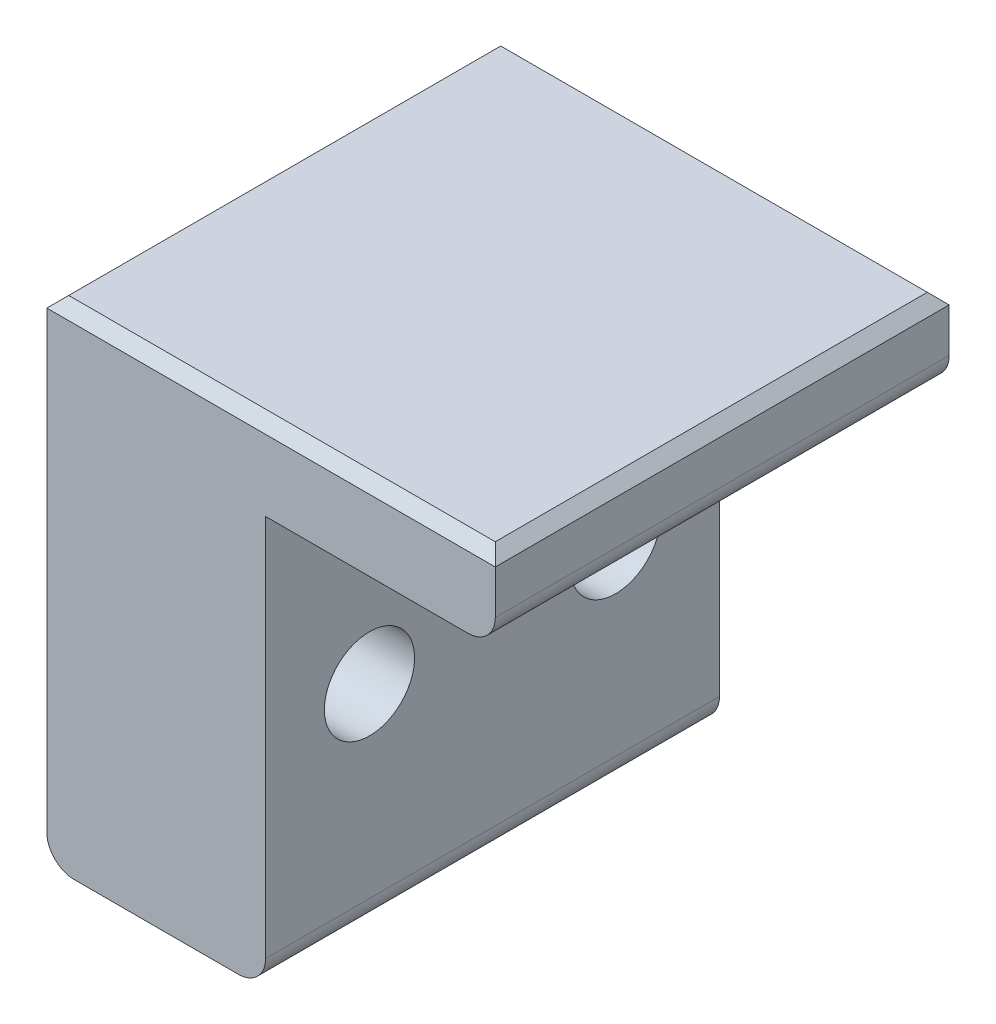
ISO-10303-21;
HEADER;
FILE_DESCRIPTION(('STEP AP214'),'2;1');
FILE_NAME('part.step','',(''),(''),'','','');
FILE_SCHEMA(('AUTOMOTIVE_DESIGN { 1 0 10303 214 1 1 1 1 }'));
ENDSEC;
DATA;
#1=APPLICATION_CONTEXT('core data for automotive mechanical design processes');
#2=APPLICATION_PROTOCOL_DEFINITION('international standard','automotive_design',2000,#1);
#3=PRODUCT_CONTEXT('',#1,'mechanical');
#4=PRODUCT('Part','Part','',(#3));
#5=PRODUCT_RELATED_PRODUCT_CATEGORY('part','',(#4));
#6=PRODUCT_DEFINITION_FORMATION('','',#4);
#7=PRODUCT_DEFINITION_CONTEXT('part definition',#1,'design');
#8=PRODUCT_DEFINITION('design','',#6,#7);
#9=PRODUCT_DEFINITION_SHAPE('','',#8);
#10=(LENGTH_UNIT() NAMED_UNIT(*) SI_UNIT(.MILLI.,.METRE.));
#11=(NAMED_UNIT(*) PLANE_ANGLE_UNIT() SI_UNIT($,.RADIAN.));
#12=(NAMED_UNIT(*) SI_UNIT($,.STERADIAN.) SOLID_ANGLE_UNIT());
#13=UNCERTAINTY_MEASURE_WITH_UNIT(LENGTH_MEASURE(1.E-05),#10,'distance_accuracy_value','');
#14=(GEOMETRIC_REPRESENTATION_CONTEXT(3) GLOBAL_UNCERTAINTY_ASSIGNED_CONTEXT((#13)) GLOBAL_UNIT_ASSIGNED_CONTEXT((#10,
#11,#12)) REPRESENTATION_CONTEXT('',''));
#15=CARTESIAN_POINT('',(0.,0.,0.));
#16=DIRECTION('',(0.,0.,1.));
#17=DIRECTION('',(1.,0.,0.));
#18=AXIS2_PLACEMENT_3D('',#15,#16,#17);
#19=CARTESIAN_POINT('',(0.,-15.,16.6));
#20=DIRECTION('',(-1.,0.,0.));
#21=DIRECTION('',(0.,0.,1.));
#22=AXIS2_PLACEMENT_3D('',#19,#20,#21);
#23=PLANE('',#22);
#24=CARTESIAN_POINT('',(0.,-7.19999999999998,3.80000000000002));
#25=DIRECTION('',(-1.,0.,0.));
#26=DIRECTION('',(0.,0.,1.));
#27=AXIS2_PLACEMENT_3D('',#24,#25,#26);
#28=CIRCLE('',#27,1.65);
#29=CARTESIAN_POINT('',(0.,-7.19999999999998,5.45000000000001));
#30=VERTEX_POINT('',#29);
#31=EDGE_CURVE('E223',#30,#30,#28,.T.);
#32=ORIENTED_EDGE('',*,*,#31,.T.);
#33=EDGE_LOOP('',(#32));
#34=FACE_BOUND('',#33,.T.);
#35=CARTESIAN_POINT('',(0.,-7.19999999999998,12.8));
#36=DIRECTION('',(-1.,0.,0.));
#37=DIRECTION('',(0.,0.,1.));
#38=AXIS2_PLACEMENT_3D('',#35,#36,#37);
#39=CIRCLE('',#38,1.65);
#40=CARTESIAN_POINT('',(0.,-7.19999999999998,14.45));
#41=VERTEX_POINT('',#40);
#42=EDGE_CURVE('E229',#41,#41,#39,.T.);
#43=ORIENTED_EDGE('',*,*,#42,.T.);
#44=EDGE_LOOP('',(#43));
#45=FACE_BOUND('',#44,.T.);
#46=DIRECTION('',(0.,1.,0.));
#47=VECTOR('',#46,1.);
#48=CARTESIAN_POINT('',(0.,-15.,16.6));
#49=LINE('',#48,#47);
#50=CARTESIAN_POINT('',(0.,-14.,16.6));
#51=VERTEX_POINT('',#50);
#52=CARTESIAN_POINT('',(0.,0.,16.6));
#53=VERTEX_POINT('',#52);
#54=EDGE_CURVE('E127',#51,#53,#49,.T.);
#55=ORIENTED_EDGE('',*,*,#54,.F.);
#56=DIRECTION('',(0.,0.,-1.));
#57=VECTOR('',#56,1.);
#58=CARTESIAN_POINT('',(0.,-14.,16.6));
#59=LINE('',#58,#57);
#60=CARTESIAN_POINT('',(0.,-14.,0.));
#61=VERTEX_POINT('',#60);
#62=EDGE_CURVE('E202',#51,#61,#59,.T.);
#63=ORIENTED_EDGE('',*,*,#62,.T.);
#64=DIRECTION('',(0.,1.,0.));
#65=VECTOR('',#64,1.);
#66=CARTESIAN_POINT('',(0.,-15.,0.));
#67=LINE('',#66,#65);
#68=CARTESIAN_POINT('',(0.,0.,0.));
#69=VERTEX_POINT('',#68);
#70=EDGE_CURVE('E144',#61,#69,#67,.T.);
#71=ORIENTED_EDGE('',*,*,#70,.T.);
#72=DIRECTION('',(0.,0.,-1.));
#73=VECTOR('',#72,1.);
#74=CARTESIAN_POINT('',(0.,0.,16.6));
#75=LINE('',#74,#73);
#76=EDGE_CURVE('E140',#53,#69,#75,.T.);
#77=ORIENTED_EDGE('',*,*,#76,.F.);
#78=EDGE_LOOP('',(#55,#63,#71,#77));
#79=FACE_BOUND('',#78,.T.);
#80=ADVANCED_FACE('F46',(#34,#45,#79),#23,.F.);
#81=CARTESIAN_POINT('',(0.,0.,16.6));
#82=DIRECTION('',(0.,1.,0.));
#83=DIRECTION('',(0.,0.,1.));
#84=AXIS2_PLACEMENT_3D('',#81,#82,#83);
#85=PLANE('',#84);
#86=DIRECTION('',(1.,0.,0.));
#87=VECTOR('',#86,1.);
#88=CARTESIAN_POINT('',(0.,0.,0.));
#89=LINE('',#88,#87);
#90=CARTESIAN_POINT('',(7.4,0.,0.));
#91=VERTEX_POINT('',#90);
#92=EDGE_CURVE('E218',#69,#91,#89,.T.);
#93=ORIENTED_EDGE('',*,*,#92,.T.);
#94=DIRECTION('',(0.,0.,-1.));
#95=VECTOR('',#94,1.);
#96=CARTESIAN_POINT('',(7.4,0.,16.6));
#97=LINE('',#96,#95);
#98=CARTESIAN_POINT('',(7.4,0.,16.6));
#99=VERTEX_POINT('',#98);
#100=EDGE_CURVE('E11',#91,#99,#97,.F.);
#101=ORIENTED_EDGE('',*,*,#100,.T.);
#102=DIRECTION('',(1.,0.,0.));
#103=VECTOR('',#102,1.);
#104=CARTESIAN_POINT('',(0.,0.,16.6));
#105=LINE('',#104,#103);
#106=EDGE_CURVE('E130',#53,#99,#105,.T.);
#107=ORIENTED_EDGE('',*,*,#106,.F.);
#108=ORIENTED_EDGE('',*,*,#76,.T.);
#109=EDGE_LOOP('',(#93,#101,#107,#108));
#110=FACE_BOUND('',#109,.T.);
#111=ADVANCED_FACE('F139',(#110),#85,.F.);
#112=CARTESIAN_POINT('',(8.4,0.,16.6));
#113=DIRECTION('',(-1.,0.,0.));
#114=DIRECTION('',(0.,-1.,0.));
#115=AXIS2_PLACEMENT_3D('',#112,#113,#114);
#116=PLANE('',#115);
#117=DIRECTION('',(0.,1.,0.));
#118=VECTOR('',#117,1.);
#119=CARTESIAN_POINT('',(8.4,0.,16.6));
#120=LINE('',#119,#118);
#121=CARTESIAN_POINT('',(8.4,1.,16.6));
#122=VERTEX_POINT('',#121);
#123=CARTESIAN_POINT('',(8.4,2.6,16.6));
#124=VERTEX_POINT('',#123);
#125=EDGE_CURVE('E141',#122,#124,#120,.T.);
#126=ORIENTED_EDGE('',*,*,#125,.F.);
#127=DIRECTION('',(0.,0.,-1.));
#128=VECTOR('',#127,1.);
#129=CARTESIAN_POINT('',(8.4,1.,16.6));
#130=LINE('',#129,#128);
#131=CARTESIAN_POINT('',(8.4,1.,0.));
#132=VERTEX_POINT('',#131);
#133=EDGE_CURVE('E54',#122,#132,#130,.T.);
#134=ORIENTED_EDGE('',*,*,#133,.T.);
#135=DIRECTION('',(0.,1.,0.));
#136=VECTOR('',#135,1.);
#137=CARTESIAN_POINT('',(8.4,0.,0.));
#138=LINE('',#137,#136);
#139=CARTESIAN_POINT('',(8.4,2.6,0.));
#140=VERTEX_POINT('',#139);
#141=EDGE_CURVE('E209',#132,#140,#138,.T.);
#142=ORIENTED_EDGE('',*,*,#141,.T.);
#143=DIRECTION('',(0.,0.,1.));
#144=VECTOR('',#143,1.);
#145=CARTESIAN_POINT('',(8.4,2.6,16.6));
#146=LINE('',#145,#144);
#147=EDGE_CURVE('E162',#140,#124,#146,.T.);
#148=ORIENTED_EDGE('',*,*,#147,.T.);
#149=EDGE_LOOP('',(#126,#134,#142,#148));
#150=FACE_BOUND('',#149,.T.);
#151=ADVANCED_FACE('F208',(#150),#116,.F.);
#152=CARTESIAN_POINT('',(8.4,3.,16.6));
#153=DIRECTION('',(0.,-1.,0.));
#154=DIRECTION('',(1.,0.,0.));
#155=AXIS2_PLACEMENT_3D('',#152,#153,#154);
#156=PLANE('',#155);
#157=DIRECTION('',(1.,0.,0.));
#158=VECTOR('',#157,1.);
#159=CARTESIAN_POINT('',(8.4,3.,16.2));
#160=LINE('',#159,#158);
#161=CARTESIAN_POINT('',(-7.6,3.,16.2));
#162=VERTEX_POINT('',#161);
#163=CARTESIAN_POINT('',(8.,3.,16.2));
#164=VERTEX_POINT('',#163);
#165=EDGE_CURVE('E157',#162,#164,#160,.T.);
#166=ORIENTED_EDGE('',*,*,#165,.T.);
#167=DIRECTION('',(0.,0.,-1.));
#168=VECTOR('',#167,1.);
#169=CARTESIAN_POINT('',(8.,3.,16.6));
#170=LINE('',#169,#168);
#171=CARTESIAN_POINT('',(8.,3.,0.399999999999998));
#172=VERTEX_POINT('',#171);
#173=EDGE_CURVE('E159',#164,#172,#170,.T.);
#174=ORIENTED_EDGE('',*,*,#173,.T.);
#175=DIRECTION('',(-1.,0.,0.));
#176=VECTOR('',#175,1.);
#177=CARTESIAN_POINT('',(-8.,3.,0.399999999999998));
#178=LINE('',#177,#176);
#179=CARTESIAN_POINT('',(-7.6,3.,0.399999999999998));
#180=VERTEX_POINT('',#179);
#181=EDGE_CURVE('E146',#172,#180,#178,.T.);
#182=ORIENTED_EDGE('',*,*,#181,.T.);
#183=DIRECTION('',(0.,0.,1.));
#184=VECTOR('',#183,1.);
#185=CARTESIAN_POINT('',(-7.6,3.,16.6));
#186=LINE('',#185,#184);
#187=EDGE_CURVE('E149',#180,#162,#186,.T.);
#188=ORIENTED_EDGE('',*,*,#187,.T.);
#189=EDGE_LOOP('',(#166,#174,#182,#188));
#190=FACE_BOUND('',#189,.T.);
#191=ADVANCED_FACE('F245',(#190),#156,.F.);
#192=CARTESIAN_POINT('',(-8.,3.,16.6));
#193=DIRECTION('',(1.,0.,0.));
#194=DIRECTION('',(0.,0.,-1.));
#195=AXIS2_PLACEMENT_3D('',#192,#193,#194);
#196=PLANE('',#195);
#197=CARTESIAN_POINT('',(-8.,-7.19999999999998,3.80000000000002));
#198=DIRECTION('',(-1.,0.,0.));
#199=DIRECTION('',(0.,0.,1.));
#200=AXIS2_PLACEMENT_3D('',#197,#198,#199);
#201=CIRCLE('',#200,1.65);
#202=CARTESIAN_POINT('',(-8.,-7.19999999999998,5.45000000000001));
#203=VERTEX_POINT('',#202);
#204=EDGE_CURVE('E232',#203,#203,#201,.T.);
#205=ORIENTED_EDGE('',*,*,#204,.F.);
#206=EDGE_LOOP('',(#205));
#207=FACE_BOUND('',#206,.T.);
#208=CARTESIAN_POINT('',(-8.,-7.19999999999998,12.8));
#209=DIRECTION('',(-1.,0.,0.));
#210=DIRECTION('',(0.,0.,1.));
#211=AXIS2_PLACEMENT_3D('',#208,#209,#210);
#212=CIRCLE('',#211,1.65);
#213=CARTESIAN_POINT('',(-8.,-7.19999999999998,14.45));
#214=VERTEX_POINT('',#213);
#215=EDGE_CURVE('E184',#214,#214,#212,.T.);
#216=ORIENTED_EDGE('',*,*,#215,.F.);
#217=EDGE_LOOP('',(#216));
#218=FACE_BOUND('',#217,.T.);
#219=DIRECTION('',(0.,-1.,0.));
#220=VECTOR('',#219,1.);
#221=CARTESIAN_POINT('',(-8.,3.,0.));
#222=LINE('',#221,#220);
#223=CARTESIAN_POINT('',(-8.,2.6,0.));
#224=VERTEX_POINT('',#223);
#225=CARTESIAN_POINT('',(-8.,-14.,0.));
#226=VERTEX_POINT('',#225);
#227=EDGE_CURVE('E217',#224,#226,#222,.T.);
#228=ORIENTED_EDGE('',*,*,#227,.T.);
#229=DIRECTION('',(0.,0.,-1.));
#230=VECTOR('',#229,1.);
#231=CARTESIAN_POINT('',(-8.,-14.,16.6));
#232=LINE('',#231,#230);
#233=CARTESIAN_POINT('',(-8.,-14.,16.6));
#234=VERTEX_POINT('',#233);
#235=EDGE_CURVE('E195',#226,#234,#232,.F.);
#236=ORIENTED_EDGE('',*,*,#235,.T.);
#237=DIRECTION('',(0.,-1.,0.));
#238=VECTOR('',#237,1.);
#239=CARTESIAN_POINT('',(-8.,3.,16.6));
#240=LINE('',#239,#238);
#241=CARTESIAN_POINT('',(-8.,2.6,16.6));
#242=VERTEX_POINT('',#241);
#243=EDGE_CURVE('E151',#242,#234,#240,.T.);
#244=ORIENTED_EDGE('',*,*,#243,.F.);
#245=DIRECTION('',(0.,0.,-1.));
#246=VECTOR('',#245,1.);
#247=CARTESIAN_POINT('',(-8.,2.6,16.6));
#248=LINE('',#247,#246);
#249=EDGE_CURVE('E167',#242,#224,#248,.T.);
#250=ORIENTED_EDGE('',*,*,#249,.T.);
#251=EDGE_LOOP('',(#228,#236,#244,#250));
#252=FACE_BOUND('',#251,.T.);
#253=ADVANCED_FACE('F241',(#207,#218,#252),#196,.F.);
#254=CARTESIAN_POINT('',(-8.,-15.,16.6));
#255=DIRECTION('',(0.,1.,0.));
#256=DIRECTION('',(0.,0.,1.));
#257=AXIS2_PLACEMENT_3D('',#254,#255,#256);
#258=PLANE('',#257);
#259=DIRECTION('',(1.,0.,0.));
#260=VECTOR('',#259,1.);
#261=CARTESIAN_POINT('',(-8.,-15.,16.6));
#262=LINE('',#261,#260);
#263=CARTESIAN_POINT('',(-7.,-15.,16.6));
#264=VERTEX_POINT('',#263);
#265=CARTESIAN_POINT('',(-1.,-15.,16.6));
#266=VERTEX_POINT('',#265);
#267=EDGE_CURVE('E147',#264,#266,#262,.T.);
#268=ORIENTED_EDGE('',*,*,#267,.F.);
#269=DIRECTION('',(0.,0.,-1.));
#270=VECTOR('',#269,1.);
#271=CARTESIAN_POINT('',(-7.,-15.,16.6));
#272=LINE('',#271,#270);
#273=CARTESIAN_POINT('',(-7.,-15.,0.));
#274=VERTEX_POINT('',#273);
#275=EDGE_CURVE('E186',#264,#274,#272,.T.);
#276=ORIENTED_EDGE('',*,*,#275,.T.);
#277=DIRECTION('',(1.,0.,0.));
#278=VECTOR('',#277,1.);
#279=CARTESIAN_POINT('',(-8.,-15.,0.));
#280=LINE('',#279,#278);
#281=CARTESIAN_POINT('',(-1.,-15.,0.));
#282=VERTEX_POINT('',#281);
#283=EDGE_CURVE('E136',#274,#282,#280,.T.);
#284=ORIENTED_EDGE('',*,*,#283,.T.);
#285=DIRECTION('',(0.,0.,-1.));
#286=VECTOR('',#285,1.);
#287=CARTESIAN_POINT('',(-1.,-15.,16.6));
#288=LINE('',#287,#286);
#289=EDGE_CURVE('E172',#282,#266,#288,.F.);
#290=ORIENTED_EDGE('',*,*,#289,.T.);
#291=EDGE_LOOP('',(#268,#276,#284,#290));
#292=FACE_BOUND('',#291,.T.);
#293=ADVANCED_FACE('F244',(#292),#258,.F.);
#294=CARTESIAN_POINT('',(0.,0.,16.6));
#295=DIRECTION('',(0.,0.,-1.));
#296=DIRECTION('',(-1.,0.,0.));
#297=AXIS2_PLACEMENT_3D('',#294,#295,#296);
#298=PLANE('',#297);
#299=ORIENTED_EDGE('',*,*,#243,.T.);
#300=CARTESIAN_POINT('',(-7.,-14.,16.6));
#301=DIRECTION('',(0.,0.,-1.));
#302=DIRECTION('',(-1.,0.,0.));
#303=AXIS2_PLACEMENT_3D('',#300,#301,#302);
#304=CIRCLE('',#303,1.);
#305=EDGE_CURVE('E200',#234,#264,#304,.F.);
#306=ORIENTED_EDGE('',*,*,#305,.T.);
#307=ORIENTED_EDGE('',*,*,#267,.T.);
#308=CARTESIAN_POINT('',(-1.,-14.,16.6));
#309=DIRECTION('',(0.,0.,-1.));
#310=DIRECTION('',(-1.,0.,0.));
#311=AXIS2_PLACEMENT_3D('',#308,#309,#310);
#312=CIRCLE('',#311,1.);
#313=EDGE_CURVE('E67',#266,#51,#312,.F.);
#314=ORIENTED_EDGE('',*,*,#313,.T.);
#315=ORIENTED_EDGE('',*,*,#54,.T.);
#316=ORIENTED_EDGE('',*,*,#106,.T.);
#317=CARTESIAN_POINT('',(7.4,1.,16.6));
#318=DIRECTION('',(0.,0.,-1.));
#319=DIRECTION('',(-1.,0.,0.));
#320=AXIS2_PLACEMENT_3D('',#317,#318,#319);
#321=CIRCLE('',#320,1.);
#322=EDGE_CURVE('E197',#99,#122,#321,.F.);
#323=ORIENTED_EDGE('',*,*,#322,.T.);
#324=ORIENTED_EDGE('',*,*,#125,.T.);
#325=DIRECTION('',(-1.,0.,0.));
#326=VECTOR('',#325,1.);
#327=CARTESIAN_POINT('',(0.,2.6,16.6));
#328=LINE('',#327,#326);
#329=EDGE_CURVE('E165',#124,#242,#328,.T.);
#330=ORIENTED_EDGE('',*,*,#329,.T.);
#331=EDGE_LOOP('',(#299,#306,#307,#314,#315,#316,#323,#324,#330));
#332=FACE_BOUND('',#331,.T.);
#333=ADVANCED_FACE('F129',(#332),#298,.F.);
#334=CARTESIAN_POINT('',(0.,0.,0.));
#335=DIRECTION('',(0.,0.,-1.));
#336=DIRECTION('',(-1.,0.,0.));
#337=AXIS2_PLACEMENT_3D('',#334,#335,#336);
#338=PLANE('',#337);
#339=ORIENTED_EDGE('',*,*,#283,.F.);
#340=CARTESIAN_POINT('',(-7.,-14.,0.));
#341=DIRECTION('',(0.,0.,-1.));
#342=DIRECTION('',(-1.,0.,0.));
#343=AXIS2_PLACEMENT_3D('',#340,#341,#342);
#344=CIRCLE('',#343,1.);
#345=EDGE_CURVE('E193',#274,#226,#344,.T.);
#346=ORIENTED_EDGE('',*,*,#345,.T.);
#347=ORIENTED_EDGE('',*,*,#227,.F.);
#348=DIRECTION('',(1.,0.,0.));
#349=VECTOR('',#348,1.);
#350=CARTESIAN_POINT('',(8.4,2.6,0.));
#351=LINE('',#350,#349);
#352=EDGE_CURVE('E169',#224,#140,#351,.T.);
#353=ORIENTED_EDGE('',*,*,#352,.T.);
#354=ORIENTED_EDGE('',*,*,#141,.F.);
#355=CARTESIAN_POINT('',(7.4,1.,0.));
#356=DIRECTION('',(0.,0.,-1.));
#357=DIRECTION('',(-1.,0.,0.));
#358=AXIS2_PLACEMENT_3D('',#355,#356,#357);
#359=CIRCLE('',#358,1.);
#360=EDGE_CURVE('E189',#132,#91,#359,.T.);
#361=ORIENTED_EDGE('',*,*,#360,.T.);
#362=ORIENTED_EDGE('',*,*,#92,.F.);
#363=ORIENTED_EDGE('',*,*,#70,.F.);
#364=CARTESIAN_POINT('',(-1.,-14.,0.));
#365=DIRECTION('',(0.,0.,-1.));
#366=DIRECTION('',(-1.,0.,0.));
#367=AXIS2_PLACEMENT_3D('',#364,#365,#366);
#368=CIRCLE('',#367,1.);
#369=EDGE_CURVE('E191',#61,#282,#368,.T.);
#370=ORIENTED_EDGE('',*,*,#369,.T.);
#371=EDGE_LOOP('',(#339,#346,#347,#353,#354,#361,#362,#363,#370));
#372=FACE_BOUND('',#371,.T.);
#373=ADVANCED_FACE('F213',(#372),#338,.T.);
#374=CARTESIAN_POINT('',(8.4,-7.19999999999998,12.8));
#375=DIRECTION('',(-1.,0.,0.));
#376=DIRECTION('',(0.,0.,1.));
#377=AXIS2_PLACEMENT_3D('',#374,#375,#376);
#378=CYLINDRICAL_SURFACE('',#377,1.65);
#379=ORIENTED_EDGE('',*,*,#215,.T.);
#380=EDGE_LOOP('',(#379));
#381=FACE_BOUND('',#380,.T.);
#382=ORIENTED_EDGE('',*,*,#42,.F.);
#383=EDGE_LOOP('',(#382));
#384=FACE_BOUND('',#383,.T.);
#385=ADVANCED_FACE('F345',(#381,#384),#378,.F.);
#386=CARTESIAN_POINT('',(8.4,-7.19999999999998,3.80000000000002));
#387=DIRECTION('',(-1.,0.,0.));
#388=DIRECTION('',(0.,0.,1.));
#389=AXIS2_PLACEMENT_3D('',#386,#387,#388);
#390=CYLINDRICAL_SURFACE('',#389,1.65);
#391=ORIENTED_EDGE('',*,*,#204,.T.);
#392=EDGE_LOOP('',(#391));
#393=FACE_BOUND('',#392,.T.);
#394=ORIENTED_EDGE('',*,*,#31,.F.);
#395=EDGE_LOOP('',(#394));
#396=FACE_BOUND('',#395,.T.);
#397=ADVANCED_FACE('F238',(#393,#396),#390,.F.);
#398=CARTESIAN_POINT('',(-8.,2.6,16.6));
#399=DIRECTION('',(0.707106781186544,-0.707106781186551,0.));
#400=DIRECTION('',(0.,0.,-1.));
#401=AXIS2_PLACEMENT_3D('',#398,#399,#400);
#402=PLANE('',#401);
#403=DIRECTION('',(-0.577350269189629,-0.577350269189624,-0.577350269189625));
#404=VECTOR('',#403,1.);
#405=CARTESIAN_POINT('',(-2.26666666666661,8.33333333333334,5.73333333333335));
#406=LINE('',#405,#404);
#407=EDGE_CURVE('E178',#224,#180,#406,.F.);
#408=ORIENTED_EDGE('',*,*,#407,.F.);
#409=ORIENTED_EDGE('',*,*,#249,.F.);
#410=DIRECTION('',(0.577350269189629,0.577350269189624,-0.577350269189625));
#411=VECTOR('',#410,1.);
#412=CARTESIAN_POINT('',(-8.,2.6,16.6));
#413=LINE('',#412,#411);
#414=EDGE_CURVE('E181',#162,#242,#413,.F.);
#415=ORIENTED_EDGE('',*,*,#414,.F.);
#416=ORIENTED_EDGE('',*,*,#187,.F.);
#417=EDGE_LOOP('',(#408,#409,#415,#416));
#418=FACE_BOUND('',#417,.T.);
#419=ADVANCED_FACE('F275',(#418),#402,.F.);
#420=CARTESIAN_POINT('',(0.,2.6,16.6));
#421=DIRECTION('',(0.,-0.707106781186548,-0.707106781186547));
#422=DIRECTION('',(-1.,0.,0.));
#423=AXIS2_PLACEMENT_3D('',#420,#421,#422);
#424=PLANE('',#423);
#425=ORIENTED_EDGE('',*,*,#414,.T.);
#426=ORIENTED_EDGE('',*,*,#329,.F.);
#427=DIRECTION('',(-0.577350269189626,0.577350269189626,-0.577350269189626));
#428=VECTOR('',#427,1.);
#429=CARTESIAN_POINT('',(5.6,5.4,13.8));
#430=LINE('',#429,#428);
#431=EDGE_CURVE('E175',#164,#124,#430,.F.);
#432=ORIENTED_EDGE('',*,*,#431,.F.);
#433=ORIENTED_EDGE('',*,*,#165,.F.);
#434=EDGE_LOOP('',(#425,#426,#432,#433));
#435=FACE_BOUND('',#434,.T.);
#436=ADVANCED_FACE('F271',(#435),#424,.F.);
#437=CARTESIAN_POINT('',(8.4,3.,0.399999999999998));
#438=DIRECTION('',(0.,0.707106781186548,-0.707106781186547));
#439=DIRECTION('',(1.,0.,0.));
#440=AXIS2_PLACEMENT_3D('',#437,#438,#439);
#441=PLANE('',#440);
#442=ORIENTED_EDGE('',*,*,#407,.T.);
#443=ORIENTED_EDGE('',*,*,#181,.F.);
#444=DIRECTION('',(-0.577350269189626,0.577350269189626,0.577350269189626));
#445=VECTOR('',#444,1.);
#446=CARTESIAN_POINT('',(8.13333333333334,2.86666666666667,0.266666666666665));
#447=LINE('',#446,#445);
#448=EDGE_CURVE('E173',#140,#172,#447,.T.);
#449=ORIENTED_EDGE('',*,*,#448,.F.);
#450=ORIENTED_EDGE('',*,*,#352,.F.);
#451=EDGE_LOOP('',(#442,#443,#449,#450));
#452=FACE_BOUND('',#451,.T.);
#453=ADVANCED_FACE('F278',(#452),#441,.T.);
#454=CARTESIAN_POINT('',(8.,3.,16.6));
#455=DIRECTION('',(-0.707106781186548,-0.707106781186548,0.));
#456=DIRECTION('',(0.,0.,-1.));
#457=AXIS2_PLACEMENT_3D('',#454,#455,#456);
#458=PLANE('',#457);
#459=ORIENTED_EDGE('',*,*,#431,.T.);
#460=ORIENTED_EDGE('',*,*,#147,.F.);
#461=ORIENTED_EDGE('',*,*,#448,.T.);
#462=ORIENTED_EDGE('',*,*,#173,.F.);
#463=EDGE_LOOP('',(#459,#460,#461,#462));
#464=FACE_BOUND('',#463,.T.);
#465=ADVANCED_FACE('F267',(#464),#458,.F.);
#466=CARTESIAN_POINT('',(-7.,-14.,16.6));
#467=DIRECTION('',(0.,0.,-1.));
#468=DIRECTION('',(-1.,0.,0.));
#469=AXIS2_PLACEMENT_3D('',#466,#467,#468);
#470=CYLINDRICAL_SURFACE('',#469,1.);
#471=ORIENTED_EDGE('',*,*,#305,.F.);
#472=ORIENTED_EDGE('',*,*,#235,.F.);
#473=ORIENTED_EDGE('',*,*,#345,.F.);
#474=ORIENTED_EDGE('',*,*,#275,.F.);
#475=EDGE_LOOP('',(#471,#472,#473,#474));
#476=FACE_BOUND('',#475,.T.);
#477=ADVANCED_FACE('F255',(#476),#470,.T.);
#478=CARTESIAN_POINT('',(-1.,-14.,16.6));
#479=DIRECTION('',(0.,0.,-1.));
#480=DIRECTION('',(-1.,0.,0.));
#481=AXIS2_PLACEMENT_3D('',#478,#479,#480);
#482=CYLINDRICAL_SURFACE('',#481,1.);
#483=ORIENTED_EDGE('',*,*,#313,.F.);
#484=ORIENTED_EDGE('',*,*,#289,.F.);
#485=ORIENTED_EDGE('',*,*,#369,.F.);
#486=ORIENTED_EDGE('',*,*,#62,.F.);
#487=EDGE_LOOP('',(#483,#484,#485,#486));
#488=FACE_BOUND('',#487,.T.);
#489=ADVANCED_FACE('F262',(#488),#482,.T.);
#490=CARTESIAN_POINT('',(7.4,1.,16.6));
#491=DIRECTION('',(0.,0.,-1.));
#492=DIRECTION('',(-1.,0.,0.));
#493=AXIS2_PLACEMENT_3D('',#490,#491,#492);
#494=CYLINDRICAL_SURFACE('',#493,1.);
#495=ORIENTED_EDGE('',*,*,#322,.F.);
#496=ORIENTED_EDGE('',*,*,#100,.F.);
#497=ORIENTED_EDGE('',*,*,#360,.F.);
#498=ORIENTED_EDGE('',*,*,#133,.F.);
#499=EDGE_LOOP('',(#495,#496,#497,#498));
#500=FACE_BOUND('',#499,.T.);
#501=ADVANCED_FACE('F48',(#500),#494,.T.);
#502=CLOSED_SHELL('',(#80,#111,#151,#191,#253,#293,#333,#373,#385,#397,#419,#436,#453,#465,#477,
#489,#501));
#503=MANIFOLD_SOLID_BREP('B2',#502);
#504=ADVANCED_BREP_SHAPE_REPRESENTATION('',(#18,#503),#14);
#505=SHAPE_DEFINITION_REPRESENTATION(#9,#504);
ENDSEC;
END-ISO-10303-21;
